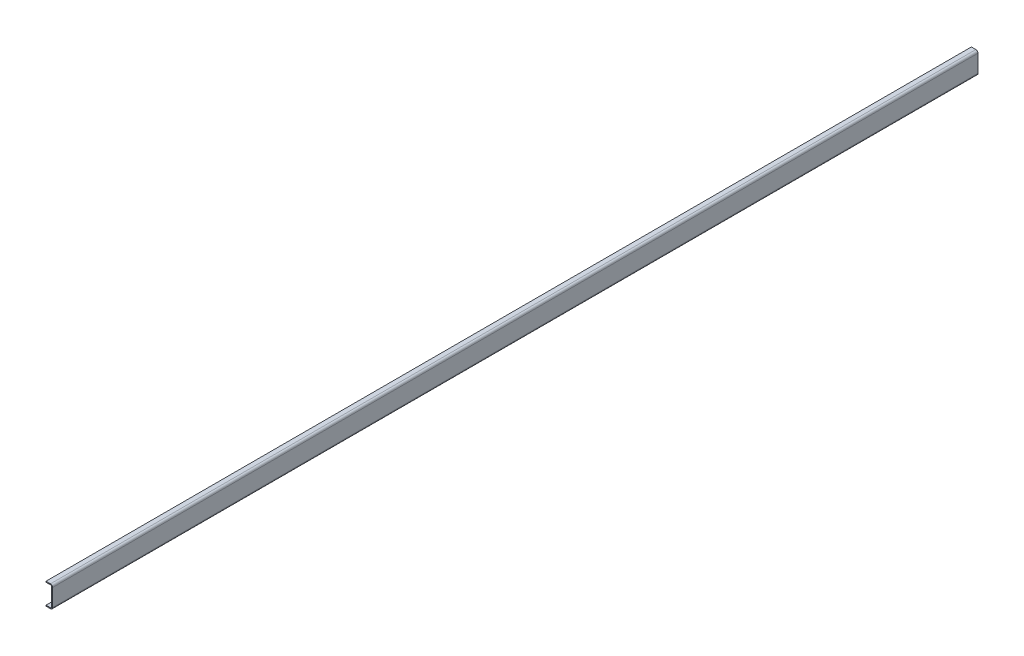
ISO-10303-21;
HEADER;
FILE_DESCRIPTION(('STEP AP214'),'2;1');
FILE_NAME('part.step','',(''),(''),'','','');
FILE_SCHEMA(('AUTOMOTIVE_DESIGN { 1 0 10303 214 1 1 1 1 }'));
ENDSEC;
DATA;
#1=APPLICATION_CONTEXT('core data for automotive mechanical design processes');
#2=APPLICATION_PROTOCOL_DEFINITION('international standard','automotive_design',2000,#1);
#3=PRODUCT_CONTEXT('',#1,'mechanical');
#4=PRODUCT('Part','Part','',(#3));
#5=PRODUCT_RELATED_PRODUCT_CATEGORY('part','',(#4));
#6=PRODUCT_DEFINITION_FORMATION('','',#4);
#7=PRODUCT_DEFINITION_CONTEXT('part definition',#1,'design');
#8=PRODUCT_DEFINITION('design','',#6,#7);
#9=PRODUCT_DEFINITION_SHAPE('','',#8);
#10=(LENGTH_UNIT() NAMED_UNIT(*) SI_UNIT(.MILLI.,.METRE.));
#11=(NAMED_UNIT(*) PLANE_ANGLE_UNIT() SI_UNIT($,.RADIAN.));
#12=(NAMED_UNIT(*) SI_UNIT($,.STERADIAN.) SOLID_ANGLE_UNIT());
#13=UNCERTAINTY_MEASURE_WITH_UNIT(LENGTH_MEASURE(1.E-05),#10,'distance_accuracy_value','');
#14=(GEOMETRIC_REPRESENTATION_CONTEXT(3) GLOBAL_UNCERTAINTY_ASSIGNED_CONTEXT((#13)) GLOBAL_UNIT_ASSIGNED_CONTEXT((#10,
#11,#12)) REPRESENTATION_CONTEXT('',''));
#15=CARTESIAN_POINT('',(0.,0.,0.));
#16=DIRECTION('',(0.,0.,1.));
#17=DIRECTION('',(1.,0.,0.));
#18=AXIS2_PLACEMENT_3D('',#15,#16,#17);
#19=CARTESIAN_POINT('',(-69.85,9.525,0.));
#20=DIRECTION('',(0.,0.,1.));
#21=DIRECTION('',(1.,0.,0.));
#22=AXIS2_PLACEMENT_3D('',#19,#20,#21);
#23=PLANE('',#22);
#24=DIRECTION('',(0.,-1.,0.));
#25=VECTOR('',#24,1.);
#26=CARTESIAN_POINT('',(0.,0.,0.));
#27=LINE('',#26,#25);
#28=CARTESIAN_POINT('',(0.,206.375,0.));
#29=VERTEX_POINT('',#28);
#30=CARTESIAN_POINT('',(0.,22.225,0.));
#31=VERTEX_POINT('',#30);
#32=EDGE_CURVE('E147',#29,#31,#27,.T.);
#33=ORIENTED_EDGE('',*,*,#32,.F.);
#34=CARTESIAN_POINT('',(-22.225,206.375,0.));
#35=DIRECTION('',(0.,0.,1.));
#36=DIRECTION('',(1.,0.,0.));
#37=AXIS2_PLACEMENT_3D('',#34,#35,#36);
#38=CIRCLE('',#37,22.225);
#39=CARTESIAN_POINT('',(-22.225,228.6,0.));
#40=VERTEX_POINT('',#39);
#41=EDGE_CURVE('E194',#29,#40,#38,.T.);
#42=ORIENTED_EDGE('',*,*,#41,.T.);
#43=DIRECTION('',(1.,0.,0.));
#44=VECTOR('',#43,1.);
#45=CARTESIAN_POINT('',(-69.85,228.6,0.));
#46=LINE('',#45,#44);
#47=CARTESIAN_POINT('',(-69.85,228.6,0.));
#48=VERTEX_POINT('',#47);
#49=EDGE_CURVE('E153',#48,#40,#46,.T.);
#50=ORIENTED_EDGE('',*,*,#49,.F.);
#51=DIRECTION('',(0.,1.,0.));
#52=VECTOR('',#51,1.);
#53=CARTESIAN_POINT('',(-69.85,219.075,0.));
#54=LINE('',#53,#52);
#55=CARTESIAN_POINT('',(-69.85,219.075,0.));
#56=VERTEX_POINT('',#55);
#57=EDGE_CURVE('E155',#56,#48,#54,.T.);
#58=ORIENTED_EDGE('',*,*,#57,.F.);
#59=DIRECTION('',(1.,0.,0.));
#60=VECTOR('',#59,1.);
#61=CARTESIAN_POINT('',(-69.85,219.075,0.));
#62=LINE('',#61,#60);
#63=CARTESIAN_POINT('',(-22.225,219.075,0.));
#64=VERTEX_POINT('',#63);
#65=EDGE_CURVE('E158',#56,#64,#62,.T.);
#66=ORIENTED_EDGE('',*,*,#65,.T.);
#67=CARTESIAN_POINT('',(-22.225,206.375,0.));
#68=DIRECTION('',(0.,0.,1.));
#69=DIRECTION('',(1.,0.,0.));
#70=AXIS2_PLACEMENT_3D('',#67,#68,#69);
#71=CIRCLE('',#70,12.7);
#72=CARTESIAN_POINT('',(-9.525,206.375,0.));
#73=VERTEX_POINT('',#72);
#74=EDGE_CURVE('E180',#64,#73,#71,.F.);
#75=ORIENTED_EDGE('',*,*,#74,.T.);
#76=DIRECTION('',(0.,1.,0.));
#77=VECTOR('',#76,1.);
#78=CARTESIAN_POINT('',(-9.525,0.,0.));
#79=LINE('',#78,#77);
#80=CARTESIAN_POINT('',(-9.525,22.225,0.));
#81=VERTEX_POINT('',#80);
#82=EDGE_CURVE('E140',#73,#81,#79,.F.);
#83=ORIENTED_EDGE('',*,*,#82,.T.);
#84=CARTESIAN_POINT('',(-22.225,22.225,0.));
#85=DIRECTION('',(0.,0.,1.));
#86=DIRECTION('',(1.,0.,0.));
#87=AXIS2_PLACEMENT_3D('',#84,#85,#86);
#88=CIRCLE('',#87,12.7);
#89=CARTESIAN_POINT('',(-22.225,9.525,0.));
#90=VERTEX_POINT('',#89);
#91=EDGE_CURVE('E128',#81,#90,#88,.F.);
#92=ORIENTED_EDGE('',*,*,#91,.T.);
#93=DIRECTION('',(1.,0.,0.));
#94=VECTOR('',#93,1.);
#95=CARTESIAN_POINT('',(-69.85,9.525,0.));
#96=LINE('',#95,#94);
#97=CARTESIAN_POINT('',(-69.85,9.525,0.));
#98=VERTEX_POINT('',#97);
#99=EDGE_CURVE('E121',#90,#98,#96,.F.);
#100=ORIENTED_EDGE('',*,*,#99,.T.);
#101=DIRECTION('',(0.,1.,0.));
#102=VECTOR('',#101,1.);
#103=CARTESIAN_POINT('',(-69.85,0.,0.));
#104=LINE('',#103,#102);
#105=CARTESIAN_POINT('',(-69.85,0.,0.));
#106=VERTEX_POINT('',#105);
#107=EDGE_CURVE('E126',#106,#98,#104,.T.);
#108=ORIENTED_EDGE('',*,*,#107,.F.);
#109=DIRECTION('',(-1.,0.,0.));
#110=VECTOR('',#109,1.);
#111=CARTESIAN_POINT('',(-69.85,0.,0.));
#112=LINE('',#111,#110);
#113=CARTESIAN_POINT('',(-22.225,0.,0.));
#114=VERTEX_POINT('',#113);
#115=EDGE_CURVE('E145',#114,#106,#112,.T.);
#116=ORIENTED_EDGE('',*,*,#115,.F.);
#117=CARTESIAN_POINT('',(-22.225,22.225,0.));
#118=DIRECTION('',(0.,0.,1.));
#119=DIRECTION('',(1.,0.,0.));
#120=AXIS2_PLACEMENT_3D('',#117,#118,#119);
#121=CIRCLE('',#120,22.225);
#122=EDGE_CURVE('E192',#114,#31,#121,.T.);
#123=ORIENTED_EDGE('',*,*,#122,.T.);
#124=EDGE_LOOP('',(#33,#42,#50,#58,#66,#75,#83,#92,#100,#108,#116,#123));
#125=FACE_BOUND('',#124,.T.);
#126=ADVANCED_FACE('F30',(#125),#23,.T.);
#127=CARTESIAN_POINT('',(-69.85,0.,-10018.0334338539));
#128=DIRECTION('',(1.,0.,0.));
#129=DIRECTION('',(0.,0.,-1.));
#130=AXIS2_PLACEMENT_3D('',#127,#128,#129);
#131=PLANE('',#130);
#132=DIRECTION('',(0.,0.,1.));
#133=VECTOR('',#132,1.);
#134=CARTESIAN_POINT('',(-69.85,9.525,-10018.0334338539));
#135=LINE('',#134,#133);
#136=CARTESIAN_POINT('',(-69.85,9.525,-9779.));
#137=VERTEX_POINT('',#136);
#138=EDGE_CURVE('E134',#137,#98,#135,.T.);
#139=ORIENTED_EDGE('',*,*,#138,.F.);
#140=DIRECTION('',(0.,-1.,0.));
#141=VECTOR('',#140,1.);
#142=CARTESIAN_POINT('',(-69.85,0.,-9779.));
#143=LINE('',#142,#141);
#144=CARTESIAN_POINT('',(-69.85,0.,-9779.));
#145=VERTEX_POINT('',#144);
#146=EDGE_CURVE('E164',#137,#145,#143,.T.);
#147=ORIENTED_EDGE('',*,*,#146,.T.);
#148=DIRECTION('',(0.,0.,1.));
#149=VECTOR('',#148,1.);
#150=CARTESIAN_POINT('',(-69.85,0.,-10018.0334338539));
#151=LINE('',#150,#149);
#152=EDGE_CURVE('E139',#145,#106,#151,.T.);
#153=ORIENTED_EDGE('',*,*,#152,.T.);
#154=ORIENTED_EDGE('',*,*,#107,.T.);
#155=EDGE_LOOP('',(#139,#147,#153,#154));
#156=FACE_BOUND('',#155,.T.);
#157=ADVANCED_FACE('F143',(#156),#131,.F.);
#158=CARTESIAN_POINT('',(-69.85,0.,-10018.0334338539));
#159=DIRECTION('',(0.,1.,0.));
#160=DIRECTION('',(0.,0.,1.));
#161=AXIS2_PLACEMENT_3D('',#158,#159,#160);
#162=PLANE('',#161);
#163=DIRECTION('',(1.,0.,0.));
#164=VECTOR('',#163,1.);
#165=CARTESIAN_POINT('',(-69.85,0.,-9779.));
#166=LINE('',#165,#164);
#167=CARTESIAN_POINT('',(-22.225,0.,-9779.));
#168=VERTEX_POINT('',#167);
#169=EDGE_CURVE('E169',#145,#168,#166,.T.);
#170=ORIENTED_EDGE('',*,*,#169,.T.);
#171=DIRECTION('',(0.,0.,1.));
#172=VECTOR('',#171,1.);
#173=CARTESIAN_POINT('',(-22.225,0.,-10018.0334338539));
#174=LINE('',#173,#172);
#175=EDGE_CURVE('E11',#168,#114,#174,.T.);
#176=ORIENTED_EDGE('',*,*,#175,.T.);
#177=ORIENTED_EDGE('',*,*,#115,.T.);
#178=ORIENTED_EDGE('',*,*,#152,.F.);
#179=EDGE_LOOP('',(#170,#176,#177,#178));
#180=FACE_BOUND('',#179,.T.);
#181=ADVANCED_FACE('F246',(#180),#162,.F.);
#182=CARTESIAN_POINT('',(0.,0.,-10018.0334338539));
#183=DIRECTION('',(-1.,0.,0.));
#184=DIRECTION('',(0.,0.,1.));
#185=AXIS2_PLACEMENT_3D('',#182,#183,#184);
#186=PLANE('',#185);
#187=DIRECTION('',(0.,1.,0.));
#188=VECTOR('',#187,1.);
#189=CARTESIAN_POINT('',(0.,0.,-9779.));
#190=LINE('',#189,#188);
#191=CARTESIAN_POINT('',(0.,22.225,-9779.));
#192=VERTEX_POINT('',#191);
#193=CARTESIAN_POINT('',(0.,206.375,-9779.));
#194=VERTEX_POINT('',#193);
#195=EDGE_CURVE('E200',#192,#194,#190,.T.);
#196=ORIENTED_EDGE('',*,*,#195,.T.);
#197=DIRECTION('',(0.,0.,1.));
#198=VECTOR('',#197,1.);
#199=CARTESIAN_POINT('',(0.,206.375,-10018.0334338539));
#200=LINE('',#199,#198);
#201=EDGE_CURVE('E189',#194,#29,#200,.T.);
#202=ORIENTED_EDGE('',*,*,#201,.T.);
#203=ORIENTED_EDGE('',*,*,#32,.T.);
#204=DIRECTION('',(0.,0.,1.));
#205=VECTOR('',#204,1.);
#206=CARTESIAN_POINT('',(0.,22.225,-10018.0334338539));
#207=LINE('',#206,#205);
#208=EDGE_CURVE('E187',#31,#192,#207,.F.);
#209=ORIENTED_EDGE('',*,*,#208,.T.);
#210=EDGE_LOOP('',(#196,#202,#203,#209));
#211=FACE_BOUND('',#210,.T.);
#212=ADVANCED_FACE('F206',(#211),#186,.F.);
#213=CARTESIAN_POINT('',(-69.85,228.6,-10018.0334338539));
#214=DIRECTION('',(0.,-1.,0.));
#215=DIRECTION('',(1.,0.,0.));
#216=AXIS2_PLACEMENT_3D('',#213,#214,#215);
#217=PLANE('',#216);
#218=ORIENTED_EDGE('',*,*,#49,.T.);
#219=DIRECTION('',(0.,0.,1.));
#220=VECTOR('',#219,1.);
#221=CARTESIAN_POINT('',(-22.225,228.6,-10018.0334338539));
#222=LINE('',#221,#220);
#223=CARTESIAN_POINT('',(-22.225,228.6,-9779.));
#224=VERTEX_POINT('',#223);
#225=EDGE_CURVE('E53',#40,#224,#222,.F.);
#226=ORIENTED_EDGE('',*,*,#225,.T.);
#227=DIRECTION('',(-1.,0.,0.));
#228=VECTOR('',#227,1.);
#229=CARTESIAN_POINT('',(-69.85,228.6,-9779.));
#230=LINE('',#229,#228);
#231=CARTESIAN_POINT('',(-69.85,228.6,-9779.));
#232=VERTEX_POINT('',#231);
#233=EDGE_CURVE('E202',#224,#232,#230,.T.);
#234=ORIENTED_EDGE('',*,*,#233,.T.);
#235=DIRECTION('',(0.,0.,1.));
#236=VECTOR('',#235,1.);
#237=CARTESIAN_POINT('',(-69.85,228.6,-10018.0334338539));
#238=LINE('',#237,#236);
#239=EDGE_CURVE('E165',#232,#48,#238,.T.);
#240=ORIENTED_EDGE('',*,*,#239,.T.);
#241=EDGE_LOOP('',(#218,#226,#234,#240));
#242=FACE_BOUND('',#241,.T.);
#243=ADVANCED_FACE('F212',(#242),#217,.F.);
#244=CARTESIAN_POINT('',(-69.85,219.075,-10018.0334338539));
#245=DIRECTION('',(1.,0.,0.));
#246=DIRECTION('',(0.,0.,-1.));
#247=AXIS2_PLACEMENT_3D('',#244,#245,#246);
#248=PLANE('',#247);
#249=ORIENTED_EDGE('',*,*,#239,.F.);
#250=DIRECTION('',(0.,-1.,0.));
#251=VECTOR('',#250,1.);
#252=CARTESIAN_POINT('',(-69.85,219.075,-9779.));
#253=LINE('',#252,#251);
#254=CARTESIAN_POINT('',(-69.85,219.075,-9779.));
#255=VERTEX_POINT('',#254);
#256=EDGE_CURVE('E241',#232,#255,#253,.T.);
#257=ORIENTED_EDGE('',*,*,#256,.T.);
#258=DIRECTION('',(0.,0.,1.));
#259=VECTOR('',#258,1.);
#260=CARTESIAN_POINT('',(-69.85,219.075,-10018.0334338539));
#261=LINE('',#260,#259);
#262=EDGE_CURVE('E162',#255,#56,#261,.T.);
#263=ORIENTED_EDGE('',*,*,#262,.T.);
#264=ORIENTED_EDGE('',*,*,#57,.T.);
#265=EDGE_LOOP('',(#249,#257,#263,#264));
#266=FACE_BOUND('',#265,.T.);
#267=ADVANCED_FACE('F216',(#266),#248,.F.);
#268=CARTESIAN_POINT('',(-69.85,219.075,-10018.0334338539));
#269=DIRECTION('',(0.,-1.,0.));
#270=DIRECTION('',(1.,0.,0.));
#271=AXIS2_PLACEMENT_3D('',#268,#269,#270);
#272=PLANE('',#271);
#273=DIRECTION('',(-1.,0.,0.));
#274=VECTOR('',#273,1.);
#275=CARTESIAN_POINT('',(-69.85,219.075,-9779.));
#276=LINE('',#275,#274);
#277=CARTESIAN_POINT('',(-22.225,219.075,-9779.));
#278=VERTEX_POINT('',#277);
#279=EDGE_CURVE('E223',#278,#255,#276,.T.);
#280=ORIENTED_EDGE('',*,*,#279,.F.);
#281=DIRECTION('',(0.,0.,1.));
#282=VECTOR('',#281,1.);
#283=CARTESIAN_POINT('',(-22.225,219.075,0.));
#284=LINE('',#283,#282);
#285=EDGE_CURVE('E170',#278,#64,#284,.T.);
#286=ORIENTED_EDGE('',*,*,#285,.T.);
#287=ORIENTED_EDGE('',*,*,#65,.F.);
#288=ORIENTED_EDGE('',*,*,#262,.F.);
#289=EDGE_LOOP('',(#280,#286,#287,#288));
#290=FACE_BOUND('',#289,.T.);
#291=ADVANCED_FACE('F221',(#290),#272,.T.);
#292=CARTESIAN_POINT('',(-9.525,0.,-10018.0334338539));
#293=DIRECTION('',(-1.,0.,0.));
#294=DIRECTION('',(0.,0.,1.));
#295=AXIS2_PLACEMENT_3D('',#292,#293,#294);
#296=PLANE('',#295);
#297=ORIENTED_EDGE('',*,*,#82,.F.);
#298=DIRECTION('',(0.,0.,1.));
#299=VECTOR('',#298,1.);
#300=CARTESIAN_POINT('',(-9.525,206.375,-9779.));
#301=LINE('',#300,#299);
#302=CARTESIAN_POINT('',(-9.525,206.375,-9779.));
#303=VERTEX_POINT('',#302);
#304=EDGE_CURVE('E176',#73,#303,#301,.F.);
#305=ORIENTED_EDGE('',*,*,#304,.T.);
#306=DIRECTION('',(0.,1.,0.));
#307=VECTOR('',#306,1.);
#308=CARTESIAN_POINT('',(-9.525,0.,-9779.));
#309=LINE('',#308,#307);
#310=CARTESIAN_POINT('',(-9.525,22.225,-9779.));
#311=VERTEX_POINT('',#310);
#312=EDGE_CURVE('E234',#311,#303,#309,.T.);
#313=ORIENTED_EDGE('',*,*,#312,.F.);
#314=DIRECTION('',(0.,0.,1.));
#315=VECTOR('',#314,1.);
#316=CARTESIAN_POINT('',(-9.525,22.225,0.));
#317=LINE('',#316,#315);
#318=EDGE_CURVE('E173',#311,#81,#317,.T.);
#319=ORIENTED_EDGE('',*,*,#318,.T.);
#320=EDGE_LOOP('',(#297,#305,#313,#319));
#321=FACE_BOUND('',#320,.T.);
#322=ADVANCED_FACE('F230',(#321),#296,.T.);
#323=CARTESIAN_POINT('',(-69.85,9.525,-10018.0334338539));
#324=DIRECTION('',(0.,1.,0.));
#325=DIRECTION('',(0.,0.,1.));
#326=AXIS2_PLACEMENT_3D('',#323,#324,#325);
#327=PLANE('',#326);
#328=ORIENTED_EDGE('',*,*,#99,.F.);
#329=DIRECTION('',(0.,0.,1.));
#330=VECTOR('',#329,1.);
#331=CARTESIAN_POINT('',(-22.225,9.525,-9779.));
#332=LINE('',#331,#330);
#333=CARTESIAN_POINT('',(-22.225,9.525,-9779.));
#334=VERTEX_POINT('',#333);
#335=EDGE_CURVE('E178',#90,#334,#332,.F.);
#336=ORIENTED_EDGE('',*,*,#335,.T.);
#337=DIRECTION('',(1.,0.,0.));
#338=VECTOR('',#337,1.);
#339=CARTESIAN_POINT('',(-69.85,9.525,-9779.));
#340=LINE('',#339,#338);
#341=EDGE_CURVE('E136',#137,#334,#340,.T.);
#342=ORIENTED_EDGE('',*,*,#341,.F.);
#343=ORIENTED_EDGE('',*,*,#138,.T.);
#344=EDGE_LOOP('',(#328,#336,#342,#343));
#345=FACE_BOUND('',#344,.T.);
#346=ADVANCED_FACE('F32',(#345),#327,.T.);
#347=CARTESIAN_POINT('',(0.,0.,-9779.));
#348=DIRECTION('',(0.,0.,1.));
#349=DIRECTION('',(1.,0.,0.));
#350=AXIS2_PLACEMENT_3D('',#347,#348,#349);
#351=PLANE('',#350);
#352=ORIENTED_EDGE('',*,*,#233,.F.);
#353=CARTESIAN_POINT('',(-22.225,206.375,-9779.));
#354=DIRECTION('',(0.,0.,1.));
#355=DIRECTION('',(1.,0.,0.));
#356=AXIS2_PLACEMENT_3D('',#353,#354,#355);
#357=CIRCLE('',#356,22.225);
#358=EDGE_CURVE('E38',#224,#194,#357,.F.);
#359=ORIENTED_EDGE('',*,*,#358,.T.);
#360=ORIENTED_EDGE('',*,*,#195,.F.);
#361=CARTESIAN_POINT('',(-22.225,22.225,-9779.));
#362=DIRECTION('',(0.,0.,1.));
#363=DIRECTION('',(1.,0.,0.));
#364=AXIS2_PLACEMENT_3D('',#361,#362,#363);
#365=CIRCLE('',#364,22.225);
#366=EDGE_CURVE('E45',#192,#168,#365,.F.);
#367=ORIENTED_EDGE('',*,*,#366,.T.);
#368=ORIENTED_EDGE('',*,*,#169,.F.);
#369=ORIENTED_EDGE('',*,*,#146,.F.);
#370=ORIENTED_EDGE('',*,*,#341,.T.);
#371=CARTESIAN_POINT('',(-22.225,22.225,-9779.));
#372=DIRECTION('',(0.,0.,1.));
#373=DIRECTION('',(1.,0.,0.));
#374=AXIS2_PLACEMENT_3D('',#371,#372,#373);
#375=CIRCLE('',#374,12.7);
#376=EDGE_CURVE('E185',#334,#311,#375,.T.);
#377=ORIENTED_EDGE('',*,*,#376,.T.);
#378=ORIENTED_EDGE('',*,*,#312,.T.);
#379=CARTESIAN_POINT('',(-22.225,206.375,-9779.));
#380=DIRECTION('',(0.,0.,1.));
#381=DIRECTION('',(1.,0.,0.));
#382=AXIS2_PLACEMENT_3D('',#379,#380,#381);
#383=CIRCLE('',#382,12.7);
#384=EDGE_CURVE('E182',#303,#278,#383,.T.);
#385=ORIENTED_EDGE('',*,*,#384,.T.);
#386=ORIENTED_EDGE('',*,*,#279,.T.);
#387=ORIENTED_EDGE('',*,*,#256,.F.);
#388=EDGE_LOOP('',(#352,#359,#360,#367,#368,#369,#370,#377,#378,#385,#386,#387));
#389=FACE_BOUND('',#388,.T.);
#390=ADVANCED_FACE('F199',(#389),#351,.F.);
#391=CARTESIAN_POINT('',(-22.225,206.375,-10018.0334338539));
#392=DIRECTION('',(0.,0.,-1.));
#393=DIRECTION('',(-1.,0.,0.));
#394=AXIS2_PLACEMENT_3D('',#391,#392,#393);
#395=CYLINDRICAL_SURFACE('',#394,12.7);
#396=ORIENTED_EDGE('',*,*,#384,.F.);
#397=ORIENTED_EDGE('',*,*,#304,.F.);
#398=ORIENTED_EDGE('',*,*,#74,.F.);
#399=ORIENTED_EDGE('',*,*,#285,.F.);
#400=EDGE_LOOP('',(#396,#397,#398,#399));
#401=FACE_BOUND('',#400,.T.);
#402=ADVANCED_FACE('F226',(#401),#395,.F.);
#403=CARTESIAN_POINT('',(-22.225,22.225,-10018.0334338539));
#404=DIRECTION('',(0.,0.,-1.));
#405=DIRECTION('',(-1.,0.,0.));
#406=AXIS2_PLACEMENT_3D('',#403,#404,#405);
#407=CYLINDRICAL_SURFACE('',#406,12.7);
#408=ORIENTED_EDGE('',*,*,#376,.F.);
#409=ORIENTED_EDGE('',*,*,#335,.F.);
#410=ORIENTED_EDGE('',*,*,#91,.F.);
#411=ORIENTED_EDGE('',*,*,#318,.F.);
#412=EDGE_LOOP('',(#408,#409,#410,#411));
#413=FACE_BOUND('',#412,.T.);
#414=ADVANCED_FACE('F237',(#413),#407,.F.);
#415=CARTESIAN_POINT('',(-22.225,206.375,-10018.0334338539));
#416=DIRECTION('',(0.,0.,1.));
#417=DIRECTION('',(1.,0.,0.));
#418=AXIS2_PLACEMENT_3D('',#415,#416,#417);
#419=CYLINDRICAL_SURFACE('',#418,22.225);
#420=ORIENTED_EDGE('',*,*,#358,.F.);
#421=ORIENTED_EDGE('',*,*,#225,.F.);
#422=ORIENTED_EDGE('',*,*,#41,.F.);
#423=ORIENTED_EDGE('',*,*,#201,.F.);
#424=EDGE_LOOP('',(#420,#421,#422,#423));
#425=FACE_BOUND('',#424,.T.);
#426=ADVANCED_FACE('F209',(#425),#419,.T.);
#427=CARTESIAN_POINT('',(-22.225,22.225,-10018.0334338539));
#428=DIRECTION('',(0.,0.,1.));
#429=DIRECTION('',(1.,0.,0.));
#430=AXIS2_PLACEMENT_3D('',#427,#428,#429);
#431=CYLINDRICAL_SURFACE('',#430,22.225);
#432=ORIENTED_EDGE('',*,*,#366,.F.);
#433=ORIENTED_EDGE('',*,*,#208,.F.);
#434=ORIENTED_EDGE('',*,*,#122,.F.);
#435=ORIENTED_EDGE('',*,*,#175,.F.);
#436=EDGE_LOOP('',(#432,#433,#434,#435));
#437=FACE_BOUND('',#436,.T.);
#438=ADVANCED_FACE('F248',(#437),#431,.T.);
#439=CLOSED_SHELL('',(#126,#157,#181,#212,#243,#267,#291,#322,#346,#390,#402,#414,#426,#438));
#440=MANIFOLD_SOLID_BREP('B2',#439);
#441=ADVANCED_BREP_SHAPE_REPRESENTATION('',(#18,#440),#14);
#442=SHAPE_DEFINITION_REPRESENTATION(#9,#441);
ENDSEC;
END-ISO-10303-21;
